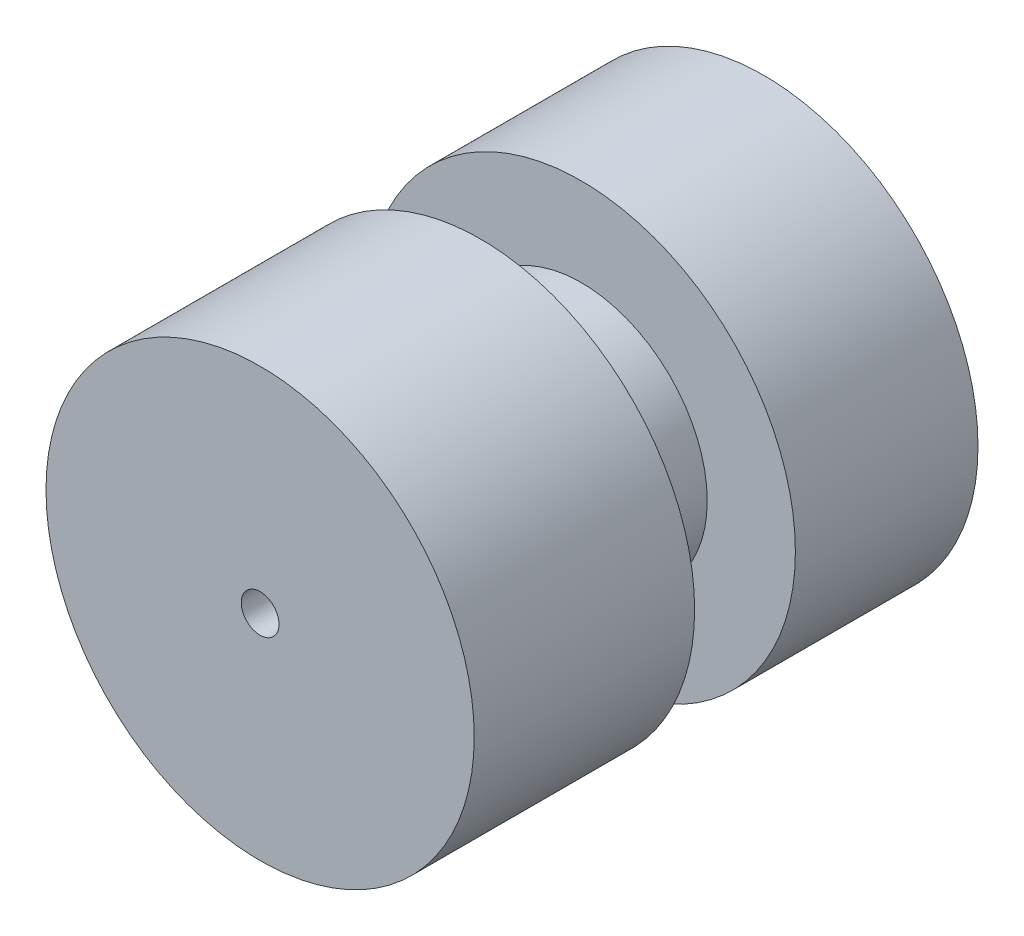
ISO-10303-21;
HEADER;
FILE_DESCRIPTION(('STEP AP214'),'2;1');
FILE_NAME('part.step','',(''),(''),'','','');
FILE_SCHEMA(('AUTOMOTIVE_DESIGN { 1 0 10303 214 1 1 1 1 }'));
ENDSEC;
DATA;
#1=APPLICATION_CONTEXT('core data for automotive mechanical design processes');
#2=APPLICATION_PROTOCOL_DEFINITION('international standard','automotive_design',2000,#1);
#3=PRODUCT_CONTEXT('',#1,'mechanical');
#4=PRODUCT('Part','Part','',(#3));
#5=PRODUCT_RELATED_PRODUCT_CATEGORY('part','',(#4));
#6=PRODUCT_DEFINITION_FORMATION('','',#4);
#7=PRODUCT_DEFINITION_CONTEXT('part definition',#1,'design');
#8=PRODUCT_DEFINITION('design','',#6,#7);
#9=PRODUCT_DEFINITION_SHAPE('','',#8);
#10=(LENGTH_UNIT() NAMED_UNIT(*) SI_UNIT(.MILLI.,.METRE.));
#11=(NAMED_UNIT(*) PLANE_ANGLE_UNIT() SI_UNIT($,.RADIAN.));
#12=(NAMED_UNIT(*) SI_UNIT($,.STERADIAN.) SOLID_ANGLE_UNIT());
#13=UNCERTAINTY_MEASURE_WITH_UNIT(LENGTH_MEASURE(1.E-05),#10,'distance_accuracy_value','');
#14=(GEOMETRIC_REPRESENTATION_CONTEXT(3) GLOBAL_UNCERTAINTY_ASSIGNED_CONTEXT((#13)) GLOBAL_UNIT_ASSIGNED_CONTEXT((#10,
#11,#12)) REPRESENTATION_CONTEXT('',''));
#15=CARTESIAN_POINT('',(0.,0.,0.));
#16=DIRECTION('',(0.,0.,1.));
#17=DIRECTION('',(1.,0.,0.));
#18=AXIS2_PLACEMENT_3D('',#15,#16,#17);
#19=CARTESIAN_POINT('',(0.,0.,40.));
#20=DIRECTION('',(0.,0.,-1.));
#21=DIRECTION('',(-1.,0.,0.));
#22=AXIS2_PLACEMENT_3D('',#19,#20,#21);
#23=CYLINDRICAL_SURFACE('',#22,17.);
#24=CARTESIAN_POINT('',(0.,0.,0.));
#25=DIRECTION('',(0.,0.,1.));
#26=DIRECTION('',(1.,0.,0.));
#27=AXIS2_PLACEMENT_3D('',#24,#25,#26);
#28=CIRCLE('',#27,17.);
#29=CARTESIAN_POINT('',(17.,0.,0.));
#30=VERTEX_POINT('',#29);
#31=EDGE_CURVE('E37',#30,#30,#28,.T.);
#32=ORIENTED_EDGE('',*,*,#31,.T.);
#33=EDGE_LOOP('',(#32));
#34=FACE_BOUND('',#33,.T.);
#35=CARTESIAN_POINT('',(0.,0.,14.5));
#36=DIRECTION('',(0.,0.,1.));
#37=DIRECTION('',(1.,0.,0.));
#38=AXIS2_PLACEMENT_3D('',#35,#36,#37);
#39=CIRCLE('',#38,17.);
#40=CARTESIAN_POINT('',(17.,0.,14.5));
#41=VERTEX_POINT('',#40);
#42=EDGE_CURVE('E49',#41,#41,#39,.T.);
#43=ORIENTED_EDGE('',*,*,#42,.F.);
#44=EDGE_LOOP('',(#43));
#45=FACE_BOUND('',#44,.T.);
#46=ADVANCED_FACE('F33',(#34,#45),#23,.T.);
#47=CARTESIAN_POINT('',(0.,0.,40.));
#48=DIRECTION('',(0.,0.,1.));
#49=DIRECTION('',(1.,0.,0.));
#50=AXIS2_PLACEMENT_3D('',#47,#48,#49);
#51=PLANE('',#50);
#52=CARTESIAN_POINT('',(0.,0.,40.));
#53=DIRECTION('',(0.,0.,1.));
#54=DIRECTION('',(1.,0.,0.));
#55=AXIS2_PLACEMENT_3D('',#52,#53,#54);
#56=CIRCLE('',#55,17.);
#57=CARTESIAN_POINT('',(17.,0.,40.));
#58=VERTEX_POINT('',#57);
#59=EDGE_CURVE('E10',#58,#58,#56,.T.);
#60=ORIENTED_EDGE('',*,*,#59,.T.);
#61=EDGE_LOOP('',(#60));
#62=FACE_BOUND('',#61,.T.);
#63=CARTESIAN_POINT('',(0.,0.,40.));
#64=DIRECTION('',(0.,0.,1.));
#65=DIRECTION('',(1.,0.,0.));
#66=AXIS2_PLACEMENT_3D('',#63,#64,#65);
#67=CIRCLE('',#66,1.5);
#68=CARTESIAN_POINT('',(1.5,0.,40.));
#69=VERTEX_POINT('',#68);
#70=EDGE_CURVE('E44',#69,#69,#67,.T.);
#71=ORIENTED_EDGE('',*,*,#70,.F.);
#72=EDGE_LOOP('',(#71));
#73=FACE_BOUND('',#72,.T.);
#74=ADVANCED_FACE('F76',(#62,#73),#51,.T.);
#75=CARTESIAN_POINT('',(0.,0.,0.));
#76=DIRECTION('',(0.,0.,1.));
#77=DIRECTION('',(1.,0.,0.));
#78=AXIS2_PLACEMENT_3D('',#75,#76,#77);
#79=PLANE('',#78);
#80=ORIENTED_EDGE('',*,*,#31,.F.);
#81=EDGE_LOOP('',(#80));
#82=FACE_BOUND('',#81,.T.);
#83=CARTESIAN_POINT('',(0.,0.,0.));
#84=DIRECTION('',(0.,0.,1.));
#85=DIRECTION('',(1.,0.,0.));
#86=AXIS2_PLACEMENT_3D('',#83,#84,#85);
#87=CIRCLE('',#86,1.5);
#88=CARTESIAN_POINT('',(1.5,0.,0.));
#89=VERTEX_POINT('',#88);
#90=EDGE_CURVE('E46',#89,#89,#87,.T.);
#91=ORIENTED_EDGE('',*,*,#90,.T.);
#92=EDGE_LOOP('',(#91));
#93=FACE_BOUND('',#92,.T.);
#94=ADVANCED_FACE('F81',(#82,#93),#79,.F.);
#95=CARTESIAN_POINT('',(0.,0.,22.5));
#96=DIRECTION('',(0.,0.,1.));
#97=DIRECTION('',(1.,0.,0.));
#98=AXIS2_PLACEMENT_3D('',#95,#96,#97);
#99=CIRCLE('',#98,17.);
#100=CARTESIAN_POINT('',(17.,0.,22.5));
#101=VERTEX_POINT('',#100);
#102=EDGE_CURVE('E52',#101,#101,#99,.T.);
#103=ORIENTED_EDGE('',*,*,#102,.T.);
#104=EDGE_LOOP('',(#103));
#105=FACE_BOUND('',#104,.T.);
#106=ORIENTED_EDGE('',*,*,#59,.F.);
#107=EDGE_LOOP('',(#106));
#108=FACE_BOUND('',#107,.T.);
#109=ADVANCED_FACE('F35',(#105,#108),#23,.T.);
#110=CARTESIAN_POINT('',(0.,0.,40.));
#111=DIRECTION('',(0.,0.,-1.));
#112=DIRECTION('',(-1.,0.,0.));
#113=AXIS2_PLACEMENT_3D('',#110,#111,#112);
#114=CYLINDRICAL_SURFACE('',#113,1.5);
#115=ORIENTED_EDGE('',*,*,#70,.T.);
#116=EDGE_LOOP('',(#115));
#117=FACE_BOUND('',#116,.T.);
#118=ORIENTED_EDGE('',*,*,#90,.F.);
#119=EDGE_LOOP('',(#118));
#120=FACE_BOUND('',#119,.T.);
#121=ADVANCED_FACE('F71',(#117,#120),#114,.F.);
#122=CARTESIAN_POINT('',(0.,0.,14.5));
#123=DIRECTION('',(0.,0.,1.));
#124=DIRECTION('',(1.,0.,0.));
#125=AXIS2_PLACEMENT_3D('',#122,#123,#124);
#126=PLANE('',#125);
#127=CARTESIAN_POINT('',(0.,0.,14.5));
#128=DIRECTION('',(0.,0.,1.));
#129=DIRECTION('',(1.,0.,0.));
#130=AXIS2_PLACEMENT_3D('',#127,#128,#129);
#131=CIRCLE('',#130,10.);
#132=CARTESIAN_POINT('',(10.,0.,14.5));
#133=VERTEX_POINT('',#132);
#134=EDGE_CURVE('E55',#133,#133,#131,.T.);
#135=ORIENTED_EDGE('',*,*,#134,.F.);
#136=EDGE_LOOP('',(#135));
#137=FACE_BOUND('',#136,.T.);
#138=ORIENTED_EDGE('',*,*,#42,.T.);
#139=EDGE_LOOP('',(#138));
#140=FACE_BOUND('',#139,.T.);
#141=ADVANCED_FACE('F67',(#137,#140),#126,.T.);
#142=CARTESIAN_POINT('',(0.,0.,22.5));
#143=DIRECTION('',(0.,0.,1.));
#144=DIRECTION('',(1.,0.,0.));
#145=AXIS2_PLACEMENT_3D('',#142,#143,#144);
#146=PLANE('',#145);
#147=CARTESIAN_POINT('',(0.,0.,22.5));
#148=DIRECTION('',(0.,0.,1.));
#149=DIRECTION('',(1.,0.,0.));
#150=AXIS2_PLACEMENT_3D('',#147,#148,#149);
#151=CIRCLE('',#150,10.);
#152=CARTESIAN_POINT('',(10.,0.,22.5));
#153=VERTEX_POINT('',#152);
#154=EDGE_CURVE('E58',#153,#153,#151,.T.);
#155=ORIENTED_EDGE('',*,*,#154,.T.);
#156=EDGE_LOOP('',(#155));
#157=FACE_BOUND('',#156,.T.);
#158=ORIENTED_EDGE('',*,*,#102,.F.);
#159=EDGE_LOOP('',(#158));
#160=FACE_BOUND('',#159,.T.);
#161=ADVANCED_FACE('F70',(#157,#160),#146,.F.);
#162=CARTESIAN_POINT('',(0.,0.,14.5));
#163=DIRECTION('',(0.,0.,1.));
#164=DIRECTION('',(1.,0.,0.));
#165=AXIS2_PLACEMENT_3D('',#162,#163,#164);
#166=CYLINDRICAL_SURFACE('',#165,10.);
#167=ORIENTED_EDGE('',*,*,#134,.T.);
#168=EDGE_LOOP('',(#167));
#169=FACE_BOUND('',#168,.T.);
#170=ORIENTED_EDGE('',*,*,#154,.F.);
#171=EDGE_LOOP('',(#170));
#172=FACE_BOUND('',#171,.T.);
#173=ADVANCED_FACE('F64',(#169,#172),#166,.T.);
#174=CLOSED_SHELL('',(#46,#74,#94,#109,#121,#141,#161,#173));
#175=MANIFOLD_SOLID_BREP('B2',#174);
#176=ADVANCED_BREP_SHAPE_REPRESENTATION('',(#18,#175),#14);
#177=SHAPE_DEFINITION_REPRESENTATION(#9,#176);
ENDSEC;
END-ISO-10303-21;
